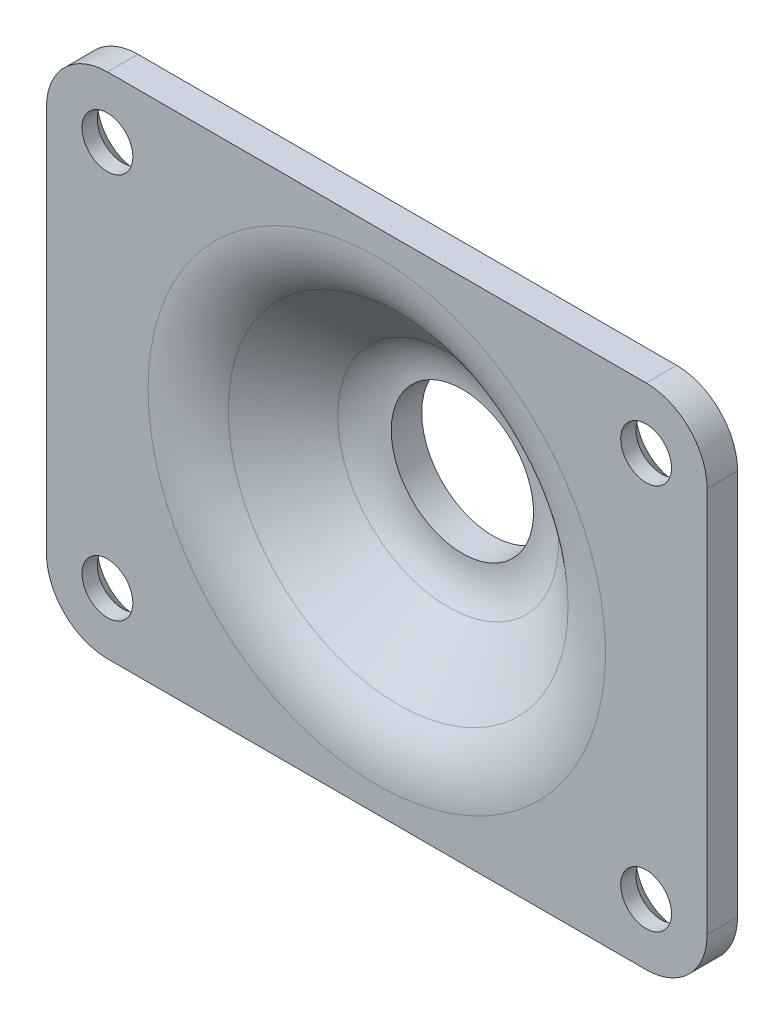
ISO-10303-21;
HEADER;
FILE_DESCRIPTION(('STEP AP214'),'2;1');
FILE_NAME('part.step','',(''),(''),'','','');
FILE_SCHEMA(('AUTOMOTIVE_DESIGN { 1 0 10303 214 1 1 1 1 }'));
ENDSEC;
DATA;
#1=APPLICATION_CONTEXT('core data for automotive mechanical design processes');
#2=APPLICATION_PROTOCOL_DEFINITION('international standard','automotive_design',2000,#1);
#3=PRODUCT_CONTEXT('',#1,'mechanical');
#4=PRODUCT('Part','Part','',(#3));
#5=PRODUCT_RELATED_PRODUCT_CATEGORY('part','',(#4));
#6=PRODUCT_DEFINITION_FORMATION('','',#4);
#7=PRODUCT_DEFINITION_CONTEXT('part definition',#1,'design');
#8=PRODUCT_DEFINITION('design','',#6,#7);
#9=PRODUCT_DEFINITION_SHAPE('','',#8);
#10=(LENGTH_UNIT() NAMED_UNIT(*) SI_UNIT(.MILLI.,.METRE.));
#11=(NAMED_UNIT(*) PLANE_ANGLE_UNIT() SI_UNIT($,.RADIAN.));
#12=(NAMED_UNIT(*) SI_UNIT($,.STERADIAN.) SOLID_ANGLE_UNIT());
#13=UNCERTAINTY_MEASURE_WITH_UNIT(LENGTH_MEASURE(1.E-05),#10,'distance_accuracy_value','');
#14=(GEOMETRIC_REPRESENTATION_CONTEXT(3) GLOBAL_UNCERTAINTY_ASSIGNED_CONTEXT((#13)) GLOBAL_UNIT_ASSIGNED_CONTEXT((#10,
#11,#12)) REPRESENTATION_CONTEXT('',''));
#15=CARTESIAN_POINT('',(0.,0.,0.));
#16=DIRECTION('',(0.,0.,1.));
#17=DIRECTION('',(1.,0.,0.));
#18=AXIS2_PLACEMENT_3D('',#15,#16,#17);
#19=CARTESIAN_POINT('',(0.,0.,6.92493494326364));
#20=DIRECTION('',(0.,0.,-1.));
#21=DIRECTION('',(-1.,0.,0.));
#22=AXIS2_PLACEMENT_3D('',#19,#20,#21);
#23=PLANE('',#22);
#24=CARTESIAN_POINT('',(-26.4999999999999,19.,6.92493494326364));
#25=DIRECTION('',(0.,0.,-1.));
#26=DIRECTION('',(-1.,0.,0.));
#27=AXIS2_PLACEMENT_3D('',#24,#25,#26);
#28=CIRCLE('',#27,3.99999999999999);
#29=CARTESIAN_POINT('',(-30.4999999999999,19.,6.92493494326364));
#30=VERTEX_POINT('',#29);
#31=EDGE_CURVE('E280',#30,#30,#28,.F.);
#32=ORIENTED_EDGE('',*,*,#31,.T.);
#33=EDGE_LOOP('',(#32));
#34=FACE_BOUND('',#33,.T.);
#35=CARTESIAN_POINT('',(26.5000000000001,19.,6.92493494326364));
#36=DIRECTION('',(0.,0.,-1.));
#37=DIRECTION('',(-1.,0.,0.));
#38=AXIS2_PLACEMENT_3D('',#35,#36,#37);
#39=CIRCLE('',#38,3.99999999999999);
#40=CARTESIAN_POINT('',(22.5000000000001,19.,6.92493494326364));
#41=VERTEX_POINT('',#40);
#42=EDGE_CURVE('E276',#41,#41,#39,.F.);
#43=ORIENTED_EDGE('',*,*,#42,.T.);
#44=EDGE_LOOP('',(#43));
#45=FACE_BOUND('',#44,.T.);
#46=CARTESIAN_POINT('',(26.5,-19.,6.92493494326364));
#47=DIRECTION('',(0.,0.,-1.));
#48=DIRECTION('',(-1.,0.,0.));
#49=AXIS2_PLACEMENT_3D('',#46,#47,#48);
#50=CIRCLE('',#49,3.99999999999999);
#51=CARTESIAN_POINT('',(22.5,-19.,6.92493494326364));
#52=VERTEX_POINT('',#51);
#53=EDGE_CURVE('E272',#52,#52,#50,.F.);
#54=ORIENTED_EDGE('',*,*,#53,.T.);
#55=EDGE_LOOP('',(#54));
#56=FACE_BOUND('',#55,.T.);
#57=CARTESIAN_POINT('',(-26.5,-19.,6.92493494326364));
#58=DIRECTION('',(0.,0.,-1.));
#59=DIRECTION('',(-1.,0.,0.));
#60=AXIS2_PLACEMENT_3D('',#57,#58,#59);
#61=CIRCLE('',#60,3.99999999999999);
#62=CARTESIAN_POINT('',(-30.5,-19.,6.92493494326364));
#63=VERTEX_POINT('',#62);
#64=EDGE_CURVE('E268',#63,#63,#61,.F.);
#65=ORIENTED_EDGE('',*,*,#64,.T.);
#66=EDGE_LOOP('',(#65));
#67=FACE_BOUND('',#66,.T.);
#68=CARTESIAN_POINT('',(0.,0.,6.92493494326364));
#69=DIRECTION('',(0.,0.,-1.));
#70=DIRECTION('',(-1.,0.,0.));
#71=AXIS2_PLACEMENT_3D('',#68,#69,#70);
#72=CIRCLE('',#71,22.5);
#73=CARTESIAN_POINT('',(-22.5,0.,6.92493494326364));
#74=VERTEX_POINT('',#73);
#75=EDGE_CURVE('E227',#74,#74,#72,.T.);
#76=ORIENTED_EDGE('',*,*,#75,.F.);
#77=EDGE_LOOP('',(#76));
#78=FACE_BOUND('',#77,.T.);
#79=DIRECTION('',(0.,1.,0.));
#80=VECTOR('',#79,1.);
#81=CARTESIAN_POINT('',(32.5,0.,6.92493494326364));
#82=LINE('',#81,#80);
#83=CARTESIAN_POINT('',(32.5,-19.,6.92493494326364));
#84=VERTEX_POINT('',#83);
#85=CARTESIAN_POINT('',(32.5,19.,6.92493494326364));
#86=VERTEX_POINT('',#85);
#87=EDGE_CURVE('E216',#84,#86,#82,.T.);
#88=ORIENTED_EDGE('',*,*,#87,.F.);
#89=CARTESIAN_POINT('',(26.5,-19.,6.92493494326364));
#90=DIRECTION('',(0.,0.,-1.));
#91=DIRECTION('',(-1.,0.,0.));
#92=AXIS2_PLACEMENT_3D('',#89,#90,#91);
#93=CIRCLE('',#92,6.);
#94=CARTESIAN_POINT('',(26.5,-25.,6.92493494326364));
#95=VERTEX_POINT('',#94);
#96=EDGE_CURVE('E219',#84,#95,#93,.T.);
#97=ORIENTED_EDGE('',*,*,#96,.T.);
#98=DIRECTION('',(1.,0.,0.));
#99=VECTOR('',#98,1.);
#100=CARTESIAN_POINT('',(0.,-25.,6.92493494326364));
#101=LINE('',#100,#99);
#102=CARTESIAN_POINT('',(-26.5,-25.,6.92493494326364));
#103=VERTEX_POINT('',#102);
#104=EDGE_CURVE('E395',#103,#95,#101,.T.);
#105=ORIENTED_EDGE('',*,*,#104,.F.);
#106=CARTESIAN_POINT('',(-26.5,-19.,6.92493494326364));
#107=DIRECTION('',(0.,0.,-1.));
#108=DIRECTION('',(-1.,0.,0.));
#109=AXIS2_PLACEMENT_3D('',#106,#107,#108);
#110=CIRCLE('',#109,6.);
#111=CARTESIAN_POINT('',(-32.5,-19.,6.92493494326364));
#112=VERTEX_POINT('',#111);
#113=EDGE_CURVE('E233',#103,#112,#110,.T.);
#114=ORIENTED_EDGE('',*,*,#113,.T.);
#115=DIRECTION('',(0.,1.,0.));
#116=VECTOR('',#115,1.);
#117=CARTESIAN_POINT('',(-32.5,0.,6.92493494326364));
#118=LINE('',#117,#116);
#119=CARTESIAN_POINT('',(-32.5,19.,6.92493494326364));
#120=VERTEX_POINT('',#119);
#121=EDGE_CURVE('E390',#112,#120,#118,.T.);
#122=ORIENTED_EDGE('',*,*,#121,.T.);
#123=CARTESIAN_POINT('',(-26.5,19.,6.92493494326364));
#124=DIRECTION('',(0.,0.,-1.));
#125=DIRECTION('',(-1.,0.,0.));
#126=AXIS2_PLACEMENT_3D('',#123,#124,#125);
#127=CIRCLE('',#126,6.);
#128=CARTESIAN_POINT('',(-26.5,25.,6.92493494326364));
#129=VERTEX_POINT('',#128);
#130=EDGE_CURVE('E221',#120,#129,#127,.T.);
#131=ORIENTED_EDGE('',*,*,#130,.T.);
#132=DIRECTION('',(1.,0.,0.));
#133=VECTOR('',#132,1.);
#134=CARTESIAN_POINT('',(0.,25.,6.92493494326364));
#135=LINE('',#134,#133);
#136=CARTESIAN_POINT('',(26.5,25.,6.92493494326364));
#137=VERTEX_POINT('',#136);
#138=EDGE_CURVE('E401',#129,#137,#135,.T.);
#139=ORIENTED_EDGE('',*,*,#138,.T.);
#140=CARTESIAN_POINT('',(26.5,19.,6.92493494326364));
#141=DIRECTION('',(0.,0.,-1.));
#142=DIRECTION('',(-1.,0.,0.));
#143=AXIS2_PLACEMENT_3D('',#140,#141,#142);
#144=CIRCLE('',#143,6.);
#145=EDGE_CURVE('E225',#137,#86,#144,.T.);
#146=ORIENTED_EDGE('',*,*,#145,.T.);
#147=EDGE_LOOP('',(#88,#97,#105,#114,#122,#131,#139,#146));
#148=FACE_BOUND('',#147,.T.);
#149=ADVANCED_FACE('F126',(#34,#45,#56,#67,#78,#148),#23,.T.);
#150=CARTESIAN_POINT('',(32.5,0.,-75.08116239102));
#151=DIRECTION('',(1.,0.,0.));
#152=DIRECTION('',(0.,0.,-1.));
#153=AXIS2_PLACEMENT_3D('',#150,#151,#152);
#154=PLANE('',#153);
#155=DIRECTION('',(0.,1.,0.));
#156=VECTOR('',#155,1.);
#157=CARTESIAN_POINT('',(32.5,0.,9.92493494326364));
#158=LINE('',#157,#156);
#159=CARTESIAN_POINT('',(32.5,-19.,9.92493494326364));
#160=VERTEX_POINT('',#159);
#161=CARTESIAN_POINT('',(32.5,19.,9.92493494326364));
#162=VERTEX_POINT('',#161);
#163=EDGE_CURVE('E197',#160,#162,#158,.T.);
#164=ORIENTED_EDGE('',*,*,#163,.F.);
#165=DIRECTION('',(0.,0.,-1.));
#166=VECTOR('',#165,1.);
#167=CARTESIAN_POINT('',(32.5,-19.,-75.08116239102));
#168=LINE('',#167,#166);
#169=EDGE_CURVE('E211',#160,#84,#168,.T.);
#170=ORIENTED_EDGE('',*,*,#169,.T.);
#171=ORIENTED_EDGE('',*,*,#87,.T.);
#172=DIRECTION('',(0.,0.,-1.));
#173=VECTOR('',#172,1.);
#174=CARTESIAN_POINT('',(32.5,19.,9.92493494326364));
#175=LINE('',#174,#173);
#176=EDGE_CURVE('E214',#86,#162,#175,.F.);
#177=ORIENTED_EDGE('',*,*,#176,.T.);
#178=EDGE_LOOP('',(#164,#170,#171,#177));
#179=FACE_BOUND('',#178,.T.);
#180=ADVANCED_FACE('F209',(#179),#154,.T.);
#181=CARTESIAN_POINT('',(0.,-25.,-75.08116239102));
#182=DIRECTION('',(0.,-1.,0.));
#183=DIRECTION('',(0.,0.,-1.));
#184=AXIS2_PLACEMENT_3D('',#181,#182,#183);
#185=PLANE('',#184);
#186=ORIENTED_EDGE('',*,*,#104,.T.);
#187=DIRECTION('',(0.,0.,-1.));
#188=VECTOR('',#187,1.);
#189=CARTESIAN_POINT('',(26.5,-25.,-75.08116239102));
#190=LINE('',#189,#188);
#191=CARTESIAN_POINT('',(26.5,-25.,9.92493494326364));
#192=VERTEX_POINT('',#191);
#193=EDGE_CURVE('E242',#95,#192,#190,.F.);
#194=ORIENTED_EDGE('',*,*,#193,.T.);
#195=DIRECTION('',(1.,0.,0.));
#196=VECTOR('',#195,1.);
#197=CARTESIAN_POINT('',(0.,-25.,9.92493494326364));
#198=LINE('',#197,#196);
#199=CARTESIAN_POINT('',(-26.5,-25.,9.92493494326364));
#200=VERTEX_POINT('',#199);
#201=EDGE_CURVE('E199',#200,#192,#198,.T.);
#202=ORIENTED_EDGE('',*,*,#201,.F.);
#203=DIRECTION('',(0.,0.,-1.));
#204=VECTOR('',#203,1.);
#205=CARTESIAN_POINT('',(-26.5,-25.,6.92493494326364));
#206=LINE('',#205,#204);
#207=EDGE_CURVE('E238',#200,#103,#206,.T.);
#208=ORIENTED_EDGE('',*,*,#207,.T.);
#209=EDGE_LOOP('',(#186,#194,#202,#208));
#210=FACE_BOUND('',#209,.T.);
#211=ADVANCED_FACE('F314',(#210),#185,.T.);
#212=CARTESIAN_POINT('',(-32.5,0.,-75.08116239102));
#213=DIRECTION('',(1.,0.,0.));
#214=DIRECTION('',(0.,0.,-1.));
#215=AXIS2_PLACEMENT_3D('',#212,#213,#214);
#216=PLANE('',#215);
#217=ORIENTED_EDGE('',*,*,#121,.F.);
#218=DIRECTION('',(0.,0.,-1.));
#219=VECTOR('',#218,1.);
#220=CARTESIAN_POINT('',(-32.5,-19.,9.92493494326364));
#221=LINE('',#220,#219);
#222=CARTESIAN_POINT('',(-32.5,-19.,9.92493494326364));
#223=VERTEX_POINT('',#222);
#224=EDGE_CURVE('E255',#112,#223,#221,.F.);
#225=ORIENTED_EDGE('',*,*,#224,.T.);
#226=DIRECTION('',(0.,1.,0.));
#227=VECTOR('',#226,1.);
#228=CARTESIAN_POINT('',(-32.5,0.,9.92493494326364));
#229=LINE('',#228,#227);
#230=CARTESIAN_POINT('',(-32.5,19.,9.92493494326364));
#231=VERTEX_POINT('',#230);
#232=EDGE_CURVE('E391',#223,#231,#229,.T.);
#233=ORIENTED_EDGE('',*,*,#232,.T.);
#234=DIRECTION('',(0.,0.,-1.));
#235=VECTOR('',#234,1.);
#236=CARTESIAN_POINT('',(-32.5,19.,-75.08116239102));
#237=LINE('',#236,#235);
#238=EDGE_CURVE('E204',#231,#120,#237,.T.);
#239=ORIENTED_EDGE('',*,*,#238,.T.);
#240=EDGE_LOOP('',(#217,#225,#233,#239));
#241=FACE_BOUND('',#240,.T.);
#242=ADVANCED_FACE('F445',(#241),#216,.F.);
#243=CARTESIAN_POINT('',(0.,25.,-75.08116239102));
#244=DIRECTION('',(0.,-1.,0.));
#245=DIRECTION('',(0.,0.,-1.));
#246=AXIS2_PLACEMENT_3D('',#243,#244,#245);
#247=PLANE('',#246);
#248=DIRECTION('',(1.,0.,0.));
#249=VECTOR('',#248,1.);
#250=CARTESIAN_POINT('',(0.,25.,9.92493494326364));
#251=LINE('',#250,#249);
#252=CARTESIAN_POINT('',(-26.5,25.,9.92493494326364));
#253=VERTEX_POINT('',#252);
#254=CARTESIAN_POINT('',(26.5,25.,9.92493494326364));
#255=VERTEX_POINT('',#254);
#256=EDGE_CURVE('E396',#253,#255,#251,.T.);
#257=ORIENTED_EDGE('',*,*,#256,.T.);
#258=DIRECTION('',(0.,0.,-1.));
#259=VECTOR('',#258,1.);
#260=CARTESIAN_POINT('',(26.5,25.,6.92493494326364));
#261=LINE('',#260,#259);
#262=EDGE_CURVE('E260',#255,#137,#261,.T.);
#263=ORIENTED_EDGE('',*,*,#262,.T.);
#264=ORIENTED_EDGE('',*,*,#138,.F.);
#265=DIRECTION('',(0.,0.,-1.));
#266=VECTOR('',#265,1.);
#267=CARTESIAN_POINT('',(-26.5,25.,-75.08116239102));
#268=LINE('',#267,#266);
#269=EDGE_CURVE('E150',#129,#253,#268,.F.);
#270=ORIENTED_EDGE('',*,*,#269,.T.);
#271=EDGE_LOOP('',(#257,#263,#264,#270));
#272=FACE_BOUND('',#271,.T.);
#273=ADVANCED_FACE('F440',(#272),#247,.F.);
#274=CARTESIAN_POINT('',(0.,0.,9.92493494326364));
#275=DIRECTION('',(0.,0.,-1.));
#276=DIRECTION('',(-1.,0.,0.));
#277=AXIS2_PLACEMENT_3D('',#274,#275,#276);
#278=PLANE('',#277);
#279=CARTESIAN_POINT('',(26.5000000000001,19.,9.92493494326364));
#280=DIRECTION('',(0.,0.,-1.));
#281=DIRECTION('',(-1.,0.,0.));
#282=AXIS2_PLACEMENT_3D('',#279,#280,#281);
#283=CIRCLE('',#282,2.5);
#284=CARTESIAN_POINT('',(24.0000000000001,19.,9.92493494326364));
#285=VERTEX_POINT('',#284);
#286=EDGE_CURVE('E369',#285,#285,#283,.T.);
#287=ORIENTED_EDGE('',*,*,#286,.T.);
#288=EDGE_LOOP('',(#287));
#289=FACE_BOUND('',#288,.T.);
#290=CARTESIAN_POINT('',(-26.4999999999999,19.,9.92493494326364));
#291=DIRECTION('',(0.,0.,-1.));
#292=DIRECTION('',(-1.,0.,0.));
#293=AXIS2_PLACEMENT_3D('',#290,#291,#292);
#294=CIRCLE('',#293,2.5);
#295=CARTESIAN_POINT('',(-28.9999999999999,19.,9.92493494326364));
#296=VERTEX_POINT('',#295);
#297=EDGE_CURVE('E365',#296,#296,#294,.T.);
#298=ORIENTED_EDGE('',*,*,#297,.T.);
#299=EDGE_LOOP('',(#298));
#300=FACE_BOUND('',#299,.T.);
#301=CARTESIAN_POINT('',(-26.5,-19.,9.92493494326364));
#302=DIRECTION('',(0.,0.,-1.));
#303=DIRECTION('',(-1.,0.,0.));
#304=AXIS2_PLACEMENT_3D('',#301,#302,#303);
#305=CIRCLE('',#304,2.5);
#306=CARTESIAN_POINT('',(-29.,-19.,9.92493494326364));
#307=VERTEX_POINT('',#306);
#308=EDGE_CURVE('E368',#307,#307,#305,.T.);
#309=ORIENTED_EDGE('',*,*,#308,.T.);
#310=EDGE_LOOP('',(#309));
#311=FACE_BOUND('',#310,.T.);
#312=CARTESIAN_POINT('',(26.5,-19.,9.92493494326364));
#313=DIRECTION('',(0.,0.,-1.));
#314=DIRECTION('',(-1.,0.,0.));
#315=AXIS2_PLACEMENT_3D('',#312,#313,#314);
#316=CIRCLE('',#315,2.5);
#317=CARTESIAN_POINT('',(24.,-19.,9.92493494326364));
#318=VERTEX_POINT('',#317);
#319=EDGE_CURVE('E374',#318,#318,#316,.T.);
#320=ORIENTED_EDGE('',*,*,#319,.T.);
#321=EDGE_LOOP('',(#320));
#322=FACE_BOUND('',#321,.T.);
#323=CARTESIAN_POINT('',(0.,0.,9.92493494326364));
#324=DIRECTION('',(0.,0.,-1.));
#325=DIRECTION('',(-1.,0.,0.));
#326=AXIS2_PLACEMENT_3D('',#323,#324,#325);
#327=CIRCLE('',#326,22.5);
#328=CARTESIAN_POINT('',(-22.5,0.,9.92493494326364));
#329=VERTEX_POINT('',#328);
#330=EDGE_CURVE('E386',#329,#329,#327,.T.);
#331=ORIENTED_EDGE('',*,*,#330,.T.);
#332=EDGE_LOOP('',(#331));
#333=FACE_BOUND('',#332,.T.);
#334=ORIENTED_EDGE('',*,*,#201,.T.);
#335=CARTESIAN_POINT('',(26.5,-19.,9.92493494326364));
#336=DIRECTION('',(0.,0.,-1.));
#337=DIRECTION('',(-1.,0.,0.));
#338=AXIS2_PLACEMENT_3D('',#335,#336,#337);
#339=CIRCLE('',#338,6.);
#340=EDGE_CURVE('E194',#192,#160,#339,.F.);
#341=ORIENTED_EDGE('',*,*,#340,.T.);
#342=ORIENTED_EDGE('',*,*,#163,.T.);
#343=CARTESIAN_POINT('',(26.5,19.,9.92493494326364));
#344=DIRECTION('',(0.,0.,-1.));
#345=DIRECTION('',(-1.,0.,0.));
#346=AXIS2_PLACEMENT_3D('',#343,#344,#345);
#347=CIRCLE('',#346,6.);
#348=EDGE_CURVE('E143',#162,#255,#347,.F.);
#349=ORIENTED_EDGE('',*,*,#348,.T.);
#350=ORIENTED_EDGE('',*,*,#256,.F.);
#351=CARTESIAN_POINT('',(-26.5,19.,9.92493494326364));
#352=DIRECTION('',(0.,0.,-1.));
#353=DIRECTION('',(-1.,0.,0.));
#354=AXIS2_PLACEMENT_3D('',#351,#352,#353);
#355=CIRCLE('',#354,6.);
#356=EDGE_CURVE('E245',#253,#231,#355,.F.);
#357=ORIENTED_EDGE('',*,*,#356,.T.);
#358=ORIENTED_EDGE('',*,*,#232,.F.);
#359=CARTESIAN_POINT('',(-26.5,-19.,9.92493494326364));
#360=DIRECTION('',(0.,0.,-1.));
#361=DIRECTION('',(-1.,0.,0.));
#362=AXIS2_PLACEMENT_3D('',#359,#360,#361);
#363=CIRCLE('',#362,6.);
#364=EDGE_CURVE('E205',#223,#200,#363,.F.);
#365=ORIENTED_EDGE('',*,*,#364,.T.);
#366=EDGE_LOOP('',(#334,#341,#342,#349,#350,#357,#358,#365));
#367=FACE_BOUND('',#366,.T.);
#368=ADVANCED_FACE('F196',(#289,#300,#311,#322,#333,#367),#278,.F.);
#369=CARTESIAN_POINT('',(0.,0.,2.90373334128612));
#370=DIRECTION('',(0.,0.,1.));
#371=DIRECTION('',(1.,0.,0.));
#372=AXIS2_PLACEMENT_3D('',#369,#370,#371);
#373=CONICAL_SURFACE('',#372,10.8567256581192,0.872664625997167);
#374=CARTESIAN_POINT('',(0.,0.,2.90373334128612));
#375=DIRECTION('',(0.,0.,-1.));
#376=DIRECTION('',(-1.,0.,0.));
#377=AXIS2_PLACEMENT_3D('',#374,#375,#376);
#378=CIRCLE('',#377,10.8567256581192);
#379=CARTESIAN_POINT('',(-10.8567256581192,0.,2.90373334128612));
#380=VERTEX_POINT('',#379);
#381=EDGE_CURVE('E407',#380,#380,#378,.T.);
#382=ORIENTED_EDGE('',*,*,#381,.T.);
#383=EDGE_LOOP('',(#382));
#384=FACE_BOUND('',#383,.T.);
#385=CARTESIAN_POINT('',(0.,0.,7.81933493133445));
#386=DIRECTION('',(0.,0.,-1.));
#387=DIRECTION('',(-1.,0.,0.));
#388=AXIS2_PLACEMENT_3D('',#385,#386,#387);
#389=CIRCLE('',#388,16.7149115128212);
#390=CARTESIAN_POINT('',(-16.7149115128212,0.,7.81933493133445));
#391=VERTEX_POINT('',#390);
#392=EDGE_CURVE('E382',#391,#391,#389,.T.);
#393=ORIENTED_EDGE('',*,*,#392,.F.);
#394=EDGE_LOOP('',(#393));
#395=FACE_BOUND('',#394,.T.);
#396=ADVANCED_FACE('F464',(#384,#395),#373,.F.);
#397=CARTESIAN_POINT('',(0.,0.,7.5));
#398=DIRECTION('',(0.,0.,-1.));
#399=DIRECTION('',(-1.,0.,0.));
#400=AXIS2_PLACEMENT_3D('',#397,#398,#399);
#401=TOROIDAL_SURFACE('',#400,6.99999999999999,6.);
#402=ORIENTED_EDGE('',*,*,#381,.F.);
#403=EDGE_LOOP('',(#402));
#404=FACE_BOUND('',#403,.T.);
#405=CARTESIAN_POINT('',(0.,0.,1.5));
#406=DIRECTION('',(0.,0.,-1.));
#407=DIRECTION('',(-1.,0.,0.));
#408=AXIS2_PLACEMENT_3D('',#405,#406,#407);
#409=CIRCLE('',#408,6.99999999999999);
#410=CARTESIAN_POINT('',(-6.99999999999999,0.,1.5));
#411=VERTEX_POINT('',#410);
#412=EDGE_CURVE('E417',#411,#411,#409,.T.);
#413=ORIENTED_EDGE('',*,*,#412,.T.);
#414=EDGE_LOOP('',(#413));
#415=FACE_BOUND('',#414,.T.);
#416=ADVANCED_FACE('F468',(#404,#415),#401,.F.);
#417=CARTESIAN_POINT('',(0.,0.,0.));
#418=DIRECTION('',(0.,0.,-1.));
#419=DIRECTION('',(-1.,0.,0.));
#420=AXIS2_PLACEMENT_3D('',#417,#418,#419);
#421=CYLINDRICAL_SURFACE('',#420,6.99999999999999);
#422=ORIENTED_EDGE('',*,*,#412,.F.);
#423=EDGE_LOOP('',(#422));
#424=FACE_BOUND('',#423,.T.);
#425=CARTESIAN_POINT('',(0.,0.,-1.5));
#426=DIRECTION('',(0.,0.,-1.));
#427=DIRECTION('',(-1.,0.,0.));
#428=AXIS2_PLACEMENT_3D('',#425,#426,#427);
#429=CIRCLE('',#428,6.99999999999999);
#430=CARTESIAN_POINT('',(-6.99999999999999,0.,-1.5));
#431=VERTEX_POINT('',#430);
#432=EDGE_CURVE('E421',#431,#431,#429,.T.);
#433=ORIENTED_EDGE('',*,*,#432,.T.);
#434=EDGE_LOOP('',(#433));
#435=FACE_BOUND('',#434,.T.);
#436=ADVANCED_FACE('F472',(#424,#435),#421,.F.);
#437=CARTESIAN_POINT('',(0.,0.,7.5));
#438=DIRECTION('',(0.,0.,-1.));
#439=DIRECTION('',(-1.,0.,0.));
#440=AXIS2_PLACEMENT_3D('',#437,#438,#439);
#441=DEGENERATE_TOROIDAL_SURFACE('',#440,6.99999999999999,9.,.T.);
#442=CARTESIAN_POINT('',(0.,0.,0.605600011929183));
#443=DIRECTION('',(0.,0.,-1.));
#444=DIRECTION('',(-1.,0.,0.));
#445=AXIS2_PLACEMENT_3D('',#442,#443,#444);
#446=CIRCLE('',#445,12.7850884871788);
#447=CARTESIAN_POINT('',(-12.7850884871788,0.,0.605600011929183));
#448=VERTEX_POINT('',#447);
#449=EDGE_CURVE('E425',#448,#448,#446,.T.);
#450=ORIENTED_EDGE('',*,*,#449,.T.);
#451=EDGE_LOOP('',(#450));
#452=FACE_BOUND('',#451,.T.);
#453=ORIENTED_EDGE('',*,*,#432,.F.);
#454=EDGE_LOOP('',(#453));
#455=FACE_BOUND('',#454,.T.);
#456=ADVANCED_FACE('F476',(#452,#455),#441,.T.);
#457=CARTESIAN_POINT('',(0.,0.,0.605600011929183));
#458=DIRECTION('',(0.,0.,1.));
#459=DIRECTION('',(1.,0.,0.));
#460=AXIS2_PLACEMENT_3D('',#457,#458,#459);
#461=CONICAL_SURFACE('',#460,12.7850884871788,0.872664625997168);
#462=CARTESIAN_POINT('',(0.,0.,5.52120160197751));
#463=DIRECTION('',(0.,0.,-1.));
#464=DIRECTION('',(-1.,0.,0.));
#465=AXIS2_PLACEMENT_3D('',#462,#463,#464);
#466=CIRCLE('',#465,18.6432743418808);
#467=CARTESIAN_POINT('',(-18.6432743418808,0.,5.52120160197751));
#468=VERTEX_POINT('',#467);
#469=EDGE_CURVE('E429',#468,#468,#466,.T.);
#470=ORIENTED_EDGE('',*,*,#469,.T.);
#471=EDGE_LOOP('',(#470));
#472=FACE_BOUND('',#471,.T.);
#473=ORIENTED_EDGE('',*,*,#449,.F.);
#474=EDGE_LOOP('',(#473));
#475=FACE_BOUND('',#474,.T.);
#476=ADVANCED_FACE('F479',(#472,#475),#461,.T.);
#477=CARTESIAN_POINT('',(0.,0.,0.92493494326364));
#478=DIRECTION('',(0.,0.,-1.));
#479=DIRECTION('',(-1.,0.,0.));
#480=AXIS2_PLACEMENT_3D('',#477,#478,#479);
#481=TOROIDAL_SURFACE('',#480,22.5,6.);
#482=ORIENTED_EDGE('',*,*,#469,.F.);
#483=EDGE_LOOP('',(#482));
#484=FACE_BOUND('',#483,.T.);
#485=ORIENTED_EDGE('',*,*,#75,.T.);
#486=EDGE_LOOP('',(#485));
#487=FACE_BOUND('',#486,.T.);
#488=ADVANCED_FACE('F319',(#484,#487),#481,.F.);
#489=CARTESIAN_POINT('',(0.,0.,0.924934943263646));
#490=DIRECTION('',(0.,0.,-1.));
#491=DIRECTION('',(-1.,0.,0.));
#492=AXIS2_PLACEMENT_3D('',#489,#490,#491);
#493=TOROIDAL_SURFACE('',#492,22.5,8.99999999999999);
#494=ORIENTED_EDGE('',*,*,#392,.T.);
#495=EDGE_LOOP('',(#494));
#496=FACE_BOUND('',#495,.T.);
#497=ORIENTED_EDGE('',*,*,#330,.F.);
#498=EDGE_LOOP('',(#497));
#499=FACE_BOUND('',#498,.T.);
#500=ADVANCED_FACE('F324',(#496,#499),#493,.T.);
#501=CARTESIAN_POINT('',(26.5,-19.,-75.08116239102));
#502=DIRECTION('',(0.,0.,-1.));
#503=DIRECTION('',(-1.,0.,0.));
#504=AXIS2_PLACEMENT_3D('',#501,#502,#503);
#505=CYLINDRICAL_SURFACE('',#504,6.);
#506=ORIENTED_EDGE('',*,*,#340,.F.);
#507=ORIENTED_EDGE('',*,*,#193,.F.);
#508=ORIENTED_EDGE('',*,*,#96,.F.);
#509=ORIENTED_EDGE('',*,*,#169,.F.);
#510=EDGE_LOOP('',(#506,#507,#508,#509));
#511=FACE_BOUND('',#510,.T.);
#512=ADVANCED_FACE('F218',(#511),#505,.T.);
#513=CARTESIAN_POINT('',(-26.5,-19.,-75.08116239102));
#514=DIRECTION('',(0.,0.,1.));
#515=DIRECTION('',(1.,0.,0.));
#516=AXIS2_PLACEMENT_3D('',#513,#514,#515);
#517=CYLINDRICAL_SURFACE('',#516,6.);
#518=ORIENTED_EDGE('',*,*,#364,.F.);
#519=ORIENTED_EDGE('',*,*,#224,.F.);
#520=ORIENTED_EDGE('',*,*,#113,.F.);
#521=ORIENTED_EDGE('',*,*,#207,.F.);
#522=EDGE_LOOP('',(#518,#519,#520,#521));
#523=FACE_BOUND('',#522,.T.);
#524=ADVANCED_FACE('F323',(#523),#517,.T.);
#525=CARTESIAN_POINT('',(26.5,19.,-75.08116239102));
#526=DIRECTION('',(0.,0.,1.));
#527=DIRECTION('',(1.,0.,0.));
#528=AXIS2_PLACEMENT_3D('',#525,#526,#527);
#529=CYLINDRICAL_SURFACE('',#528,6.);
#530=ORIENTED_EDGE('',*,*,#348,.F.);
#531=ORIENTED_EDGE('',*,*,#176,.F.);
#532=ORIENTED_EDGE('',*,*,#145,.F.);
#533=ORIENTED_EDGE('',*,*,#262,.F.);
#534=EDGE_LOOP('',(#530,#531,#532,#533));
#535=FACE_BOUND('',#534,.T.);
#536=ADVANCED_FACE('F327',(#535),#529,.T.);
#537=CARTESIAN_POINT('',(-26.5,19.,-75.08116239102));
#538=DIRECTION('',(0.,0.,-1.));
#539=DIRECTION('',(-1.,0.,0.));
#540=AXIS2_PLACEMENT_3D('',#537,#538,#539);
#541=CYLINDRICAL_SURFACE('',#540,6.);
#542=ORIENTED_EDGE('',*,*,#356,.F.);
#543=ORIENTED_EDGE('',*,*,#269,.F.);
#544=ORIENTED_EDGE('',*,*,#130,.F.);
#545=ORIENTED_EDGE('',*,*,#238,.F.);
#546=EDGE_LOOP('',(#542,#543,#544,#545));
#547=FACE_BOUND('',#546,.T.);
#548=ADVANCED_FACE('F331',(#547),#541,.T.);
#549=CARTESIAN_POINT('',(26.5,-19.,9.92493494326364));
#550=DIRECTION('',(0.,0.,-1.));
#551=DIRECTION('',(-1.,0.,0.));
#552=AXIS2_PLACEMENT_3D('',#549,#550,#551);
#553=CYLINDRICAL_SURFACE('',#552,2.5);
#554=CARTESIAN_POINT('',(26.5,-19.,8.42493494326364));
#555=DIRECTION('',(0.,0.,-1.));
#556=DIRECTION('',(-1.,0.,0.));
#557=AXIS2_PLACEMENT_3D('',#554,#555,#556);
#558=CIRCLE('',#557,2.5);
#559=CARTESIAN_POINT('',(24.,-19.,8.42493494326364));
#560=VERTEX_POINT('',#559);
#561=EDGE_CURVE('E136',#560,#560,#558,.T.);
#562=ORIENTED_EDGE('',*,*,#561,.T.);
#563=EDGE_LOOP('',(#562));
#564=FACE_BOUND('',#563,.T.);
#565=ORIENTED_EDGE('',*,*,#319,.F.);
#566=EDGE_LOOP('',(#565));
#567=FACE_BOUND('',#566,.T.);
#568=ADVANCED_FACE('F291',(#564,#567),#553,.F.);
#569=CARTESIAN_POINT('',(-26.5,-19.,9.92493494326364));
#570=DIRECTION('',(0.,0.,-1.));
#571=DIRECTION('',(-1.,0.,0.));
#572=AXIS2_PLACEMENT_3D('',#569,#570,#571);
#573=CYLINDRICAL_SURFACE('',#572,2.5);
#574=CARTESIAN_POINT('',(-26.5,-19.,8.42493494326364));
#575=DIRECTION('',(0.,0.,-1.));
#576=DIRECTION('',(-1.,0.,0.));
#577=AXIS2_PLACEMENT_3D('',#574,#575,#576);
#578=CIRCLE('',#577,2.5);
#579=CARTESIAN_POINT('',(-29.,-19.,8.42493494326364));
#580=VERTEX_POINT('',#579);
#581=EDGE_CURVE('E13',#580,#580,#578,.T.);
#582=ORIENTED_EDGE('',*,*,#581,.T.);
#583=EDGE_LOOP('',(#582));
#584=FACE_BOUND('',#583,.T.);
#585=ORIENTED_EDGE('',*,*,#308,.F.);
#586=EDGE_LOOP('',(#585));
#587=FACE_BOUND('',#586,.T.);
#588=ADVANCED_FACE('F361',(#584,#587),#573,.F.);
#589=CARTESIAN_POINT('',(-26.4999999999999,19.,9.92493494326364));
#590=DIRECTION('',(0.,0.,-1.));
#591=DIRECTION('',(-1.,0.,0.));
#592=AXIS2_PLACEMENT_3D('',#589,#590,#591);
#593=CYLINDRICAL_SURFACE('',#592,2.5);
#594=CARTESIAN_POINT('',(-26.4999999999999,19.,8.42493494326364));
#595=DIRECTION('',(0.,0.,-1.));
#596=DIRECTION('',(-1.,0.,0.));
#597=AXIS2_PLACEMENT_3D('',#594,#595,#596);
#598=CIRCLE('',#597,2.5);
#599=CARTESIAN_POINT('',(-28.9999999999999,19.,8.42493494326364));
#600=VERTEX_POINT('',#599);
#601=EDGE_CURVE('E264',#600,#600,#598,.T.);
#602=ORIENTED_EDGE('',*,*,#601,.T.);
#603=EDGE_LOOP('',(#602));
#604=FACE_BOUND('',#603,.T.);
#605=ORIENTED_EDGE('',*,*,#297,.F.);
#606=EDGE_LOOP('',(#605));
#607=FACE_BOUND('',#606,.T.);
#608=ADVANCED_FACE('F352',(#604,#607),#593,.F.);
#609=CARTESIAN_POINT('',(26.5000000000001,19.,9.92493494326364));
#610=DIRECTION('',(0.,0.,-1.));
#611=DIRECTION('',(-1.,0.,0.));
#612=AXIS2_PLACEMENT_3D('',#609,#610,#611);
#613=CYLINDRICAL_SURFACE('',#612,2.5);
#614=CARTESIAN_POINT('',(26.5000000000001,19.,8.42493494326364));
#615=DIRECTION('',(0.,0.,-1.));
#616=DIRECTION('',(-1.,0.,0.));
#617=AXIS2_PLACEMENT_3D('',#614,#615,#616);
#618=CIRCLE('',#617,2.5);
#619=CARTESIAN_POINT('',(24.0000000000001,19.,8.42493494326364));
#620=VERTEX_POINT('',#619);
#621=EDGE_CURVE('E284',#620,#620,#618,.T.);
#622=ORIENTED_EDGE('',*,*,#621,.T.);
#623=EDGE_LOOP('',(#622));
#624=FACE_BOUND('',#623,.T.);
#625=ORIENTED_EDGE('',*,*,#286,.F.);
#626=EDGE_LOOP('',(#625));
#627=FACE_BOUND('',#626,.T.);
#628=ADVANCED_FACE('F341',(#624,#627),#613,.F.);
#629=CARTESIAN_POINT('',(-26.4999999999999,19.,8.42493494326364));
#630=DIRECTION('',(0.,0.,-1.));
#631=DIRECTION('',(-1.,0.,0.));
#632=AXIS2_PLACEMENT_3D('',#629,#630,#631);
#633=CONICAL_SURFACE('',#632,2.5,0.785398163397448);
#634=ORIENTED_EDGE('',*,*,#31,.F.);
#635=EDGE_LOOP('',(#634));
#636=FACE_BOUND('',#635,.T.);
#637=ORIENTED_EDGE('',*,*,#601,.F.);
#638=EDGE_LOOP('',(#637));
#639=FACE_BOUND('',#638,.T.);
#640=ADVANCED_FACE('F303',(#636,#639),#633,.F.);
#641=CARTESIAN_POINT('',(26.5000000000001,19.,8.42493494326364));
#642=DIRECTION('',(0.,0.,-1.));
#643=DIRECTION('',(-1.,0.,0.));
#644=AXIS2_PLACEMENT_3D('',#641,#642,#643);
#645=CONICAL_SURFACE('',#644,2.5,0.785398163397448);
#646=ORIENTED_EDGE('',*,*,#42,.F.);
#647=EDGE_LOOP('',(#646));
#648=FACE_BOUND('',#647,.T.);
#649=ORIENTED_EDGE('',*,*,#621,.F.);
#650=EDGE_LOOP('',(#649));
#651=FACE_BOUND('',#650,.T.);
#652=ADVANCED_FACE('F296',(#648,#651),#645,.F.);
#653=CARTESIAN_POINT('',(26.5,-19.,8.42493494326364));
#654=DIRECTION('',(0.,0.,-1.));
#655=DIRECTION('',(-1.,0.,0.));
#656=AXIS2_PLACEMENT_3D('',#653,#654,#655);
#657=CONICAL_SURFACE('',#656,2.5,0.785398163397448);
#658=ORIENTED_EDGE('',*,*,#53,.F.);
#659=EDGE_LOOP('',(#658));
#660=FACE_BOUND('',#659,.T.);
#661=ORIENTED_EDGE('',*,*,#561,.F.);
#662=EDGE_LOOP('',(#661));
#663=FACE_BOUND('',#662,.T.);
#664=ADVANCED_FACE('F294',(#660,#663),#657,.F.);
#665=CARTESIAN_POINT('',(-26.5,-19.,8.42493494326364));
#666=DIRECTION('',(0.,0.,-1.));
#667=DIRECTION('',(-1.,0.,0.));
#668=AXIS2_PLACEMENT_3D('',#665,#666,#667);
#669=CONICAL_SURFACE('',#668,2.5,0.785398163397448);
#670=ORIENTED_EDGE('',*,*,#64,.F.);
#671=EDGE_LOOP('',(#670));
#672=FACE_BOUND('',#671,.T.);
#673=ORIENTED_EDGE('',*,*,#581,.F.);
#674=EDGE_LOOP('',(#673));
#675=FACE_BOUND('',#674,.T.);
#676=ADVANCED_FACE('F129',(#672,#675),#669,.F.);
#677=CLOSED_SHELL('',(#149,#180,#211,#242,#273,#368,#396,#416,#436,#456,#476,#488,#500,#512,
#524,#536,#548,#568,#588,#608,#628,#640,#652,#664,#676));
#678=MANIFOLD_SOLID_BREP('B2',#677);
#679=ADVANCED_BREP_SHAPE_REPRESENTATION('',(#18,#678),#14);
#680=SHAPE_DEFINITION_REPRESENTATION(#9,#679);
ENDSEC;
END-ISO-10303-21;
